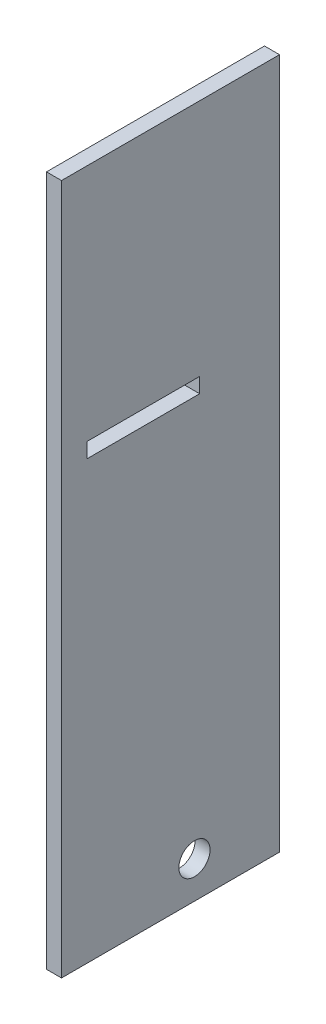
ISO-10303-21;
HEADER;
FILE_DESCRIPTION(('STEP AP214'),'2;1');
FILE_NAME('part.step','',(''),(''),'','','');
FILE_SCHEMA(('AUTOMOTIVE_DESIGN { 1 0 10303 214 1 1 1 1 }'));
ENDSEC;
DATA;
#1=APPLICATION_CONTEXT('core data for automotive mechanical design processes');
#2=APPLICATION_PROTOCOL_DEFINITION('international standard','automotive_design',2000,#1);
#3=PRODUCT_CONTEXT('',#1,'mechanical');
#4=PRODUCT('Part','Part','',(#3));
#5=PRODUCT_RELATED_PRODUCT_CATEGORY('part','',(#4));
#6=PRODUCT_DEFINITION_FORMATION('','',#4);
#7=PRODUCT_DEFINITION_CONTEXT('part definition',#1,'design');
#8=PRODUCT_DEFINITION('design','',#6,#7);
#9=PRODUCT_DEFINITION_SHAPE('','',#8);
#10=(LENGTH_UNIT() NAMED_UNIT(*) SI_UNIT(.MILLI.,.METRE.));
#11=(NAMED_UNIT(*) PLANE_ANGLE_UNIT() SI_UNIT($,.RADIAN.));
#12=(NAMED_UNIT(*) SI_UNIT($,.STERADIAN.) SOLID_ANGLE_UNIT());
#13=UNCERTAINTY_MEASURE_WITH_UNIT(LENGTH_MEASURE(1.E-05),#10,'distance_accuracy_value','');
#14=(GEOMETRIC_REPRESENTATION_CONTEXT(3) GLOBAL_UNCERTAINTY_ASSIGNED_CONTEXT((#13)) GLOBAL_UNIT_ASSIGNED_CONTEXT((#10,
#11,#12)) REPRESENTATION_CONTEXT('',''));
#15=CARTESIAN_POINT('',(0.,0.,0.));
#16=DIRECTION('',(0.,0.,1.));
#17=DIRECTION('',(1.,0.,0.));
#18=AXIS2_PLACEMENT_3D('',#15,#16,#17);
#19=CARTESIAN_POINT('',(-26.5,85.2128324188906,10.3180436334358));
#20=DIRECTION('',(0.,0.,1.));
#21=DIRECTION('',(1.,0.,0.));
#22=AXIS2_PLACEMENT_3D('',#19,#20,#21);
#23=PLANE('',#22);
#24=DIRECTION('',(0.,-1.,0.));
#25=VECTOR('',#24,1.);
#26=CARTESIAN_POINT('',(-24.5,85.2128324188906,10.3180436334358));
#27=LINE('',#26,#25);
#28=CARTESIAN_POINT('',(-24.5,115.212832418891,10.3180436334358));
#29=VERTEX_POINT('',#28);
#30=CARTESIAN_POINT('',(-24.5,23.2128324188906,10.3180436334358));
#31=VERTEX_POINT('',#30);
#32=EDGE_CURVE('E177',#29,#31,#27,.T.);
#33=ORIENTED_EDGE('',*,*,#32,.F.);
#34=DIRECTION('',(1.,0.,0.));
#35=VECTOR('',#34,1.);
#36=CARTESIAN_POINT('',(-26.5,115.212832418891,10.3180436334358));
#37=LINE('',#36,#35);
#38=CARTESIAN_POINT('',(-26.5,115.212832418891,10.3180436334358));
#39=VERTEX_POINT('',#38);
#40=EDGE_CURVE('E12',#39,#29,#37,.T.);
#41=ORIENTED_EDGE('',*,*,#40,.F.);
#42=DIRECTION('',(0.,-1.,0.));
#43=VECTOR('',#42,1.);
#44=CARTESIAN_POINT('',(-26.5,85.2128324188906,10.3180436334358));
#45=LINE('',#44,#43);
#46=CARTESIAN_POINT('',(-26.5,23.2128324188906,10.3180436334358));
#47=VERTEX_POINT('',#46);
#48=EDGE_CURVE('E163',#39,#47,#45,.T.);
#49=ORIENTED_EDGE('',*,*,#48,.T.);
#50=DIRECTION('',(1.,0.,0.));
#51=VECTOR('',#50,1.);
#52=CARTESIAN_POINT('',(-26.5,23.2128324188906,10.3180436334358));
#53=LINE('',#52,#51);
#54=EDGE_CURVE('E172',#47,#31,#53,.T.);
#55=ORIENTED_EDGE('',*,*,#54,.T.);
#56=EDGE_LOOP('',(#33,#41,#49,#55));
#57=FACE_BOUND('',#56,.T.);
#58=ADVANCED_FACE('F80',(#57),#23,.T.);
#59=CARTESIAN_POINT('',(-26.5,115.212832418891,10.3180436334358));
#60=DIRECTION('',(0.,1.,0.));
#61=DIRECTION('',(0.,0.,1.));
#62=AXIS2_PLACEMENT_3D('',#59,#60,#61);
#63=PLANE('',#62);
#64=DIRECTION('',(0.,0.,1.));
#65=VECTOR('',#64,1.);
#66=CARTESIAN_POINT('',(-24.5,115.212832418891,10.3180436334358));
#67=LINE('',#66,#65);
#68=CARTESIAN_POINT('',(-24.5,115.212832418891,-18.7219563665642));
#69=VERTEX_POINT('',#68);
#70=EDGE_CURVE('E159',#69,#29,#67,.T.);
#71=ORIENTED_EDGE('',*,*,#70,.F.);
#72=DIRECTION('',(1.,0.,0.));
#73=VECTOR('',#72,1.);
#74=CARTESIAN_POINT('',(-26.5,115.212832418891,-18.7219563665642));
#75=LINE('',#74,#73);
#76=CARTESIAN_POINT('',(-26.5,115.212832418891,-18.7219563665642));
#77=VERTEX_POINT('',#76);
#78=EDGE_CURVE('E84',#77,#69,#75,.T.);
#79=ORIENTED_EDGE('',*,*,#78,.F.);
#80=DIRECTION('',(0.,0.,1.));
#81=VECTOR('',#80,1.);
#82=CARTESIAN_POINT('',(-26.5,115.212832418891,10.3180436334358));
#83=LINE('',#82,#81);
#84=EDGE_CURVE('E171',#77,#39,#83,.T.);
#85=ORIENTED_EDGE('',*,*,#84,.T.);
#86=ORIENTED_EDGE('',*,*,#40,.T.);
#87=EDGE_LOOP('',(#71,#79,#85,#86));
#88=FACE_BOUND('',#87,.T.);
#89=ADVANCED_FACE('F82',(#88),#63,.T.);
#90=CARTESIAN_POINT('',(-26.5,85.2128324188906,-18.7219563665642));
#91=DIRECTION('',(0.,0.,-1.));
#92=DIRECTION('',(-1.,0.,0.));
#93=AXIS2_PLACEMENT_3D('',#90,#91,#92);
#94=PLANE('',#93);
#95=DIRECTION('',(0.,1.,0.));
#96=VECTOR('',#95,1.);
#97=CARTESIAN_POINT('',(-24.5,85.2128324188906,-18.7219563665642));
#98=LINE('',#97,#96);
#99=CARTESIAN_POINT('',(-24.5,23.2128324188906,-18.7219563665642));
#100=VERTEX_POINT('',#99);
#101=EDGE_CURVE('E151',#100,#69,#98,.T.);
#102=ORIENTED_EDGE('',*,*,#101,.F.);
#103=DIRECTION('',(1.,0.,0.));
#104=VECTOR('',#103,1.);
#105=CARTESIAN_POINT('',(-26.5,23.2128324188906,-18.7219563665642));
#106=LINE('',#105,#104);
#107=CARTESIAN_POINT('',(-26.5,23.2128324188906,-18.7219563665642));
#108=VERTEX_POINT('',#107);
#109=EDGE_CURVE('E139',#108,#100,#106,.T.);
#110=ORIENTED_EDGE('',*,*,#109,.F.);
#111=DIRECTION('',(0.,1.,0.));
#112=VECTOR('',#111,1.);
#113=CARTESIAN_POINT('',(-26.5,85.2128324188906,-18.7219563665642));
#114=LINE('',#113,#112);
#115=EDGE_CURVE('E153',#108,#77,#114,.T.);
#116=ORIENTED_EDGE('',*,*,#115,.T.);
#117=ORIENTED_EDGE('',*,*,#78,.T.);
#118=EDGE_LOOP('',(#102,#110,#116,#117));
#119=FACE_BOUND('',#118,.T.);
#120=ADVANCED_FACE('F150',(#119),#94,.T.);
#121=CARTESIAN_POINT('',(-26.5,23.2128324188906,10.3180436334358));
#122=DIRECTION('',(0.,-1.,0.));
#123=DIRECTION('',(0.,0.,-1.));
#124=AXIS2_PLACEMENT_3D('',#121,#122,#123);
#125=PLANE('',#124);
#126=DIRECTION('',(0.,0.,-1.));
#127=VECTOR('',#126,1.);
#128=CARTESIAN_POINT('',(-24.5,23.2128324188906,10.3180436334358));
#129=LINE('',#128,#127);
#130=EDGE_CURVE('E160',#31,#100,#129,.T.);
#131=ORIENTED_EDGE('',*,*,#130,.F.);
#132=ORIENTED_EDGE('',*,*,#54,.F.);
#133=DIRECTION('',(0.,0.,-1.));
#134=VECTOR('',#133,1.);
#135=CARTESIAN_POINT('',(-26.5,23.2128324188906,10.3180436334358));
#136=LINE('',#135,#134);
#137=EDGE_CURVE('E166',#47,#108,#136,.T.);
#138=ORIENTED_EDGE('',*,*,#137,.T.);
#139=ORIENTED_EDGE('',*,*,#109,.T.);
#140=EDGE_LOOP('',(#131,#132,#138,#139));
#141=FACE_BOUND('',#140,.T.);
#142=ADVANCED_FACE('F247',(#141),#125,.T.);
#143=CARTESIAN_POINT('',(-26.5,5.18456447563127,-1.56469467826355));
#144=DIRECTION('',(1.,0.,0.));
#145=DIRECTION('',(0.,0.,-1.));
#146=AXIS2_PLACEMENT_3D('',#143,#144,#145);
#147=PLANE('',#146);
#148=CARTESIAN_POINT('',(-26.5,28.1217775064828,-7.39334318032769));
#149=DIRECTION('',(1.,0.,0.));
#150=DIRECTION('',(0.,0.,-1.));
#151=AXIS2_PLACEMENT_3D('',#148,#149,#150);
#152=CIRCLE('',#151,2.07792985860407);
#153=CARTESIAN_POINT('',(-26.5,28.1217775064828,-9.47127303893177));
#154=VERTEX_POINT('',#153);
#155=EDGE_CURVE('E214',#154,#154,#152,.T.);
#156=ORIENTED_EDGE('',*,*,#155,.T.);
#157=EDGE_LOOP('',(#156));
#158=FACE_BOUND('',#157,.T.);
#159=DIRECTION('',(0.,0.,-1.));
#160=VECTOR('',#159,1.);
#161=CARTESIAN_POINT('',(-26.5,81.4130982977347,-1.56469467826355));
#162=LINE('',#161,#160);
#163=CARTESIAN_POINT('',(-26.5,81.4130982977347,6.91445588155831));
#164=VERTEX_POINT('',#163);
#165=CARTESIAN_POINT('',(-26.5,81.4130982977347,-8.08554411844169));
#166=VERTEX_POINT('',#165);
#167=EDGE_CURVE('E197',#164,#166,#162,.T.);
#168=ORIENTED_EDGE('',*,*,#167,.T.);
#169=DIRECTION('',(0.,1.,0.));
#170=VECTOR('',#169,1.);
#171=CARTESIAN_POINT('',(-26.5,5.18456447563127,-8.08554411844169));
#172=LINE('',#171,#170);
#173=CARTESIAN_POINT('',(-26.5,83.4130982977347,-8.08554411844169));
#174=VERTEX_POINT('',#173);
#175=EDGE_CURVE('E179',#166,#174,#172,.T.);
#176=ORIENTED_EDGE('',*,*,#175,.T.);
#177=DIRECTION('',(0.,0.,1.));
#178=VECTOR('',#177,1.);
#179=CARTESIAN_POINT('',(-26.5,83.4130982977347,-1.56469467826355));
#180=LINE('',#179,#178);
#181=CARTESIAN_POINT('',(-26.5,83.4130982977347,6.91445588155831));
#182=VERTEX_POINT('',#181);
#183=EDGE_CURVE('E185',#174,#182,#180,.T.);
#184=ORIENTED_EDGE('',*,*,#183,.T.);
#185=DIRECTION('',(0.,-1.,0.));
#186=VECTOR('',#185,1.);
#187=CARTESIAN_POINT('',(-26.5,5.18456447563127,6.91445588155831));
#188=LINE('',#187,#186);
#189=EDGE_CURVE('E188',#182,#164,#188,.T.);
#190=ORIENTED_EDGE('',*,*,#189,.T.);
#191=EDGE_LOOP('',(#168,#176,#184,#190));
#192=FACE_BOUND('',#191,.T.);
#193=ORIENTED_EDGE('',*,*,#48,.F.);
#194=ORIENTED_EDGE('',*,*,#84,.F.);
#195=ORIENTED_EDGE('',*,*,#115,.F.);
#196=ORIENTED_EDGE('',*,*,#137,.F.);
#197=EDGE_LOOP('',(#193,#194,#195,#196));
#198=FACE_BOUND('',#197,.T.);
#199=ADVANCED_FACE('F225',(#158,#192,#198),#147,.F.);
#200=CARTESIAN_POINT('',(-24.5,5.18456447563127,-1.56469467826355));
#201=DIRECTION('',(1.,0.,0.));
#202=DIRECTION('',(0.,0.,-1.));
#203=AXIS2_PLACEMENT_3D('',#200,#201,#202);
#204=PLANE('',#203);
#205=CARTESIAN_POINT('',(-24.5,28.1217775064828,-7.39334318032769));
#206=DIRECTION('',(1.,0.,0.));
#207=DIRECTION('',(0.,0.,-1.));
#208=AXIS2_PLACEMENT_3D('',#205,#206,#207);
#209=CIRCLE('',#208,2.07792985860407);
#210=CARTESIAN_POINT('',(-24.5,28.1217775064828,-9.47127303893177));
#211=VERTEX_POINT('',#210);
#212=EDGE_CURVE('E217',#211,#211,#209,.T.);
#213=ORIENTED_EDGE('',*,*,#212,.F.);
#214=EDGE_LOOP('',(#213));
#215=FACE_BOUND('',#214,.T.);
#216=DIRECTION('',(0.,1.,0.));
#217=VECTOR('',#216,1.);
#218=CARTESIAN_POINT('',(-24.5,72.4130982977347,-8.08554411844169));
#219=LINE('',#218,#217);
#220=CARTESIAN_POINT('',(-24.5,81.4130982977347,-8.08554411844169));
#221=VERTEX_POINT('',#220);
#222=CARTESIAN_POINT('',(-24.5,83.4130982977347,-8.08554411844169));
#223=VERTEX_POINT('',#222);
#224=EDGE_CURVE('E195',#221,#223,#219,.T.);
#225=ORIENTED_EDGE('',*,*,#224,.F.);
#226=DIRECTION('',(0.,0.,-1.));
#227=VECTOR('',#226,1.);
#228=CARTESIAN_POINT('',(-24.5,81.4130982977347,6.91445588155831));
#229=LINE('',#228,#227);
#230=CARTESIAN_POINT('',(-24.5,81.4130982977347,6.91445588155831));
#231=VERTEX_POINT('',#230);
#232=EDGE_CURVE('E169',#231,#221,#229,.T.);
#233=ORIENTED_EDGE('',*,*,#232,.F.);
#234=DIRECTION('',(0.,-1.,0.));
#235=VECTOR('',#234,1.);
#236=CARTESIAN_POINT('',(-24.5,72.4130982977347,6.91445588155831));
#237=LINE('',#236,#235);
#238=CARTESIAN_POINT('',(-24.5,83.4130982977347,6.91445588155831));
#239=VERTEX_POINT('',#238);
#240=EDGE_CURVE('E194',#239,#231,#237,.T.);
#241=ORIENTED_EDGE('',*,*,#240,.F.);
#242=DIRECTION('',(0.,0.,1.));
#243=VECTOR('',#242,1.);
#244=CARTESIAN_POINT('',(-24.5,83.4130982977347,6.91445588155831));
#245=LINE('',#244,#243);
#246=EDGE_CURVE('E192',#223,#239,#245,.T.);
#247=ORIENTED_EDGE('',*,*,#246,.F.);
#248=EDGE_LOOP('',(#225,#233,#241,#247));
#249=FACE_BOUND('',#248,.T.);
#250=ORIENTED_EDGE('',*,*,#32,.T.);
#251=ORIENTED_EDGE('',*,*,#130,.T.);
#252=ORIENTED_EDGE('',*,*,#101,.T.);
#253=ORIENTED_EDGE('',*,*,#70,.T.);
#254=EDGE_LOOP('',(#250,#251,#252,#253));
#255=FACE_BOUND('',#254,.T.);
#256=ADVANCED_FACE('F158',(#215,#249,#255),#204,.T.);
#257=CARTESIAN_POINT('',(-30.5,72.4130982977347,-8.08554411844169));
#258=DIRECTION('',(0.,0.,-1.));
#259=DIRECTION('',(-1.,0.,0.));
#260=AXIS2_PLACEMENT_3D('',#257,#258,#259);
#261=PLANE('',#260);
#262=DIRECTION('',(1.,0.,0.));
#263=VECTOR('',#262,1.);
#264=CARTESIAN_POINT('',(-30.5,81.4130982977347,-8.08554411844169));
#265=LINE('',#264,#263);
#266=EDGE_CURVE('E189',#166,#221,#265,.T.);
#267=ORIENTED_EDGE('',*,*,#266,.T.);
#268=ORIENTED_EDGE('',*,*,#224,.T.);
#269=DIRECTION('',(1.,0.,0.));
#270=VECTOR('',#269,1.);
#271=CARTESIAN_POINT('',(-30.5,83.4130982977347,-8.08554411844169));
#272=LINE('',#271,#270);
#273=EDGE_CURVE('E182',#174,#223,#272,.T.);
#274=ORIENTED_EDGE('',*,*,#273,.F.);
#275=ORIENTED_EDGE('',*,*,#175,.F.);
#276=EDGE_LOOP('',(#267,#268,#274,#275));
#277=FACE_BOUND('',#276,.T.);
#278=ADVANCED_FACE('F202',(#277),#261,.F.);
#279=CARTESIAN_POINT('',(-30.5,81.4130982977347,6.91445588155831));
#280=DIRECTION('',(0.,-1.,0.));
#281=DIRECTION('',(0.,0.,-1.));
#282=AXIS2_PLACEMENT_3D('',#279,#280,#281);
#283=PLANE('',#282);
#284=DIRECTION('',(1.,0.,0.));
#285=VECTOR('',#284,1.);
#286=CARTESIAN_POINT('',(-30.5,81.4130982977347,6.91445588155831));
#287=LINE('',#286,#285);
#288=EDGE_CURVE('E191',#164,#231,#287,.T.);
#289=ORIENTED_EDGE('',*,*,#288,.T.);
#290=ORIENTED_EDGE('',*,*,#232,.T.);
#291=ORIENTED_EDGE('',*,*,#266,.F.);
#292=ORIENTED_EDGE('',*,*,#167,.F.);
#293=EDGE_LOOP('',(#289,#290,#291,#292));
#294=FACE_BOUND('',#293,.T.);
#295=ADVANCED_FACE('F208',(#294),#283,.F.);
#296=CARTESIAN_POINT('',(-30.5,72.4130982977347,6.91445588155831));
#297=DIRECTION('',(0.,0.,1.));
#298=DIRECTION('',(1.,0.,0.));
#299=AXIS2_PLACEMENT_3D('',#296,#297,#298);
#300=PLANE('',#299);
#301=DIRECTION('',(1.,0.,0.));
#302=VECTOR('',#301,1.);
#303=CARTESIAN_POINT('',(-30.5,83.4130982977347,6.91445588155831));
#304=LINE('',#303,#302);
#305=EDGE_CURVE('E98',#182,#239,#304,.T.);
#306=ORIENTED_EDGE('',*,*,#305,.T.);
#307=ORIENTED_EDGE('',*,*,#240,.T.);
#308=ORIENTED_EDGE('',*,*,#288,.F.);
#309=ORIENTED_EDGE('',*,*,#189,.F.);
#310=EDGE_LOOP('',(#306,#307,#308,#309));
#311=FACE_BOUND('',#310,.T.);
#312=ADVANCED_FACE('F229',(#311),#300,.F.);
#313=CARTESIAN_POINT('',(-30.5,83.4130982977347,6.91445588155831));
#314=DIRECTION('',(0.,1.,0.));
#315=DIRECTION('',(0.,0.,1.));
#316=AXIS2_PLACEMENT_3D('',#313,#314,#315);
#317=PLANE('',#316);
#318=ORIENTED_EDGE('',*,*,#273,.T.);
#319=ORIENTED_EDGE('',*,*,#246,.T.);
#320=ORIENTED_EDGE('',*,*,#305,.F.);
#321=ORIENTED_EDGE('',*,*,#183,.F.);
#322=EDGE_LOOP('',(#318,#319,#320,#321));
#323=FACE_BOUND('',#322,.T.);
#324=ADVANCED_FACE('F227',(#323),#317,.F.);
#325=CARTESIAN_POINT('',(-29.5,28.1217775064828,-7.39334318032769));
#326=DIRECTION('',(1.,0.,0.));
#327=DIRECTION('',(0.,0.,-1.));
#328=AXIS2_PLACEMENT_3D('',#325,#326,#327);
#329=CYLINDRICAL_SURFACE('',#328,2.07792985860407);
#330=ORIENTED_EDGE('',*,*,#212,.T.);
#331=EDGE_LOOP('',(#330));
#332=FACE_BOUND('',#331,.T.);
#333=ORIENTED_EDGE('',*,*,#155,.F.);
#334=EDGE_LOOP('',(#333));
#335=FACE_BOUND('',#334,.T.);
#336=ADVANCED_FACE('F236',(#332,#335),#329,.F.);
#337=CLOSED_SHELL('',(#58,#89,#120,#142,#199,#256,#278,#295,#312,#324,#336));
#338=MANIFOLD_SOLID_BREP('B2',#337);
#339=ADVANCED_BREP_SHAPE_REPRESENTATION('',(#18,#338),#14);
#340=SHAPE_DEFINITION_REPRESENTATION(#9,#339);
ENDSEC;
END-ISO-10303-21;
